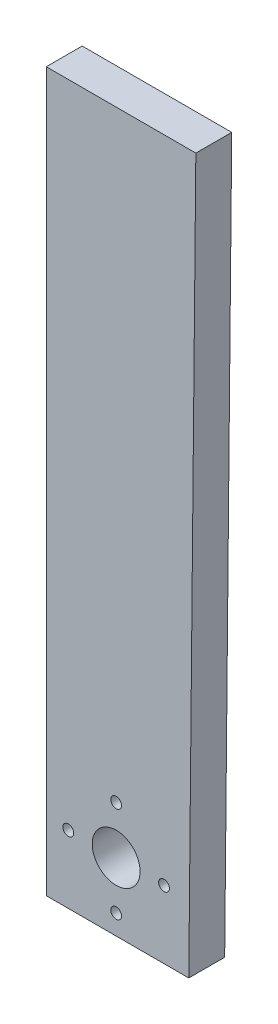
ISO-10303-21;
HEADER;
FILE_DESCRIPTION(('STEP AP214'),'2;1');
FILE_NAME('part.step','',(''),(''),'','','');
FILE_SCHEMA(('AUTOMOTIVE_DESIGN { 1 0 10303 214 1 1 1 1 }'));
ENDSEC;
DATA;
#1=APPLICATION_CONTEXT('core data for automotive mechanical design processes');
#2=APPLICATION_PROTOCOL_DEFINITION('international standard','automotive_design',2000,#1);
#3=PRODUCT_CONTEXT('',#1,'mechanical');
#4=PRODUCT('Part','Part','',(#3));
#5=PRODUCT_RELATED_PRODUCT_CATEGORY('part','',(#4));
#6=PRODUCT_DEFINITION_FORMATION('','',#4);
#7=PRODUCT_DEFINITION_CONTEXT('part definition',#1,'design');
#8=PRODUCT_DEFINITION('design','',#6,#7);
#9=PRODUCT_DEFINITION_SHAPE('','',#8);
#10=(LENGTH_UNIT() NAMED_UNIT(*) SI_UNIT(.MILLI.,.METRE.));
#11=(NAMED_UNIT(*) PLANE_ANGLE_UNIT() SI_UNIT($,.RADIAN.));
#12=(NAMED_UNIT(*) SI_UNIT($,.STERADIAN.) SOLID_ANGLE_UNIT());
#13=UNCERTAINTY_MEASURE_WITH_UNIT(LENGTH_MEASURE(1.E-05),#10,'distance_accuracy_value','');
#14=(GEOMETRIC_REPRESENTATION_CONTEXT(3) GLOBAL_UNCERTAINTY_ASSIGNED_CONTEXT((#13)) GLOBAL_UNIT_ASSIGNED_CONTEXT((#10,
#11,#12)) REPRESENTATION_CONTEXT('',''));
#15=CARTESIAN_POINT('',(0.,0.,0.));
#16=DIRECTION('',(0.,0.,1.));
#17=DIRECTION('',(1.,0.,0.));
#18=AXIS2_PLACEMENT_3D('',#15,#16,#17);
#19=CARTESIAN_POINT('',(0.,0.,6.));
#20=DIRECTION('',(0.,0.,-1.));
#21=DIRECTION('',(-1.,0.,0.));
#22=AXIS2_PLACEMENT_3D('',#19,#20,#21);
#23=PLANE('',#22);
#24=DIRECTION('',(1.,0.,0.));
#25=VECTOR('',#24,1.);
#26=CARTESIAN_POINT('',(48.8021307144799,-97.6102097446587,6.));
#27=LINE('',#26,#25);
#28=CARTESIAN_POINT('',(24.9825049823041,-97.6102097446587,6.));
#29=VERTEX_POINT('',#28);
#30=CARTESIAN_POINT('',(48.8021307144799,-97.6102097446587,6.));
#31=VERTEX_POINT('',#30);
#32=EDGE_CURVE('E85',#29,#31,#27,.T.);
#33=ORIENTED_EDGE('',*,*,#32,.T.);
#34=DIRECTION('',(0.00983597639953239,0.999951625614093,0.));
#35=VECTOR('',#34,1.);
#36=CARTESIAN_POINT('',(49.9825049823041,22.3897902553413,6.));
#37=LINE('',#36,#35);
#38=CARTESIAN_POINT('',(49.9825049823041,22.3897902553413,6.));
#39=VERTEX_POINT('',#38);
#40=EDGE_CURVE('E80',#31,#39,#37,.T.);
#41=ORIENTED_EDGE('',*,*,#40,.T.);
#42=DIRECTION('',(-1.,0.,0.));
#43=VECTOR('',#42,1.);
#44=CARTESIAN_POINT('',(49.9825049823041,22.3897902553413,6.));
#45=LINE('',#44,#43);
#46=CARTESIAN_POINT('',(24.9825049823041,22.3897902553413,6.));
#47=VERTEX_POINT('',#46);
#48=EDGE_CURVE('E83',#39,#47,#45,.T.);
#49=ORIENTED_EDGE('',*,*,#48,.T.);
#50=DIRECTION('',(0.,-1.,0.));
#51=VECTOR('',#50,1.);
#52=CARTESIAN_POINT('',(24.9825049823041,-97.6102097446587,6.));
#53=LINE('',#52,#51);
#54=EDGE_CURVE('E50',#47,#29,#53,.T.);
#55=ORIENTED_EDGE('',*,*,#54,.T.);
#56=EDGE_LOOP('',(#33,#41,#49,#55));
#57=FACE_BOUND('',#56,.T.);
#58=CARTESIAN_POINT('',(28.6640296021028,-86.2753700735329,6.));
#59=DIRECTION('',(0.,0.,1.));
#60=DIRECTION('',(1.,0.,0.));
#61=AXIS2_PLACEMENT_3D('',#58,#59,#60);
#62=CIRCLE('',#61,0.899999999999996);
#63=CARTESIAN_POINT('',(29.5640296021028,-86.2753700735329,6.));
#64=VERTEX_POINT('',#63);
#65=EDGE_CURVE('E100',#64,#64,#62,.T.);
#66=ORIENTED_EDGE('',*,*,#65,.F.);
#67=EDGE_LOOP('',(#66));
#68=FACE_BOUND('',#67,.T.);
#69=CARTESIAN_POINT('',(36.6640296021028,-78.2753700735329,6.));
#70=DIRECTION('',(0.,0.,1.));
#71=DIRECTION('',(1.,0.,0.));
#72=AXIS2_PLACEMENT_3D('',#69,#70,#71);
#73=CIRCLE('',#72,0.899999999999996);
#74=CARTESIAN_POINT('',(37.5640296021028,-78.2753700735329,6.));
#75=VERTEX_POINT('',#74);
#76=EDGE_CURVE('E115',#75,#75,#73,.T.);
#77=ORIENTED_EDGE('',*,*,#76,.F.);
#78=EDGE_LOOP('',(#77));
#79=FACE_BOUND('',#78,.T.);
#80=CARTESIAN_POINT('',(44.6640296021028,-86.2753700735329,6.));
#81=DIRECTION('',(0.,0.,1.));
#82=DIRECTION('',(1.,0.,0.));
#83=AXIS2_PLACEMENT_3D('',#80,#81,#82);
#84=CIRCLE('',#83,0.899999999999996);
#85=CARTESIAN_POINT('',(45.5640296021028,-86.2753700735329,6.));
#86=VERTEX_POINT('',#85);
#87=EDGE_CURVE('E121',#86,#86,#84,.T.);
#88=ORIENTED_EDGE('',*,*,#87,.F.);
#89=EDGE_LOOP('',(#88));
#90=FACE_BOUND('',#89,.T.);
#91=CARTESIAN_POINT('',(36.6640296021028,-94.275370073533,6.));
#92=DIRECTION('',(0.,0.,1.));
#93=DIRECTION('',(1.,0.,0.));
#94=AXIS2_PLACEMENT_3D('',#91,#92,#93);
#95=CIRCLE('',#94,0.899999999999996);
#96=CARTESIAN_POINT('',(37.5640296021028,-94.275370073533,6.));
#97=VERTEX_POINT('',#96);
#98=EDGE_CURVE('E127',#97,#97,#95,.T.);
#99=ORIENTED_EDGE('',*,*,#98,.F.);
#100=EDGE_LOOP('',(#99));
#101=FACE_BOUND('',#100,.T.);
#102=CARTESIAN_POINT('',(36.6640296021028,-86.2753700735329,6.));
#103=DIRECTION('',(0.,0.,1.));
#104=DIRECTION('',(1.,0.,0.));
#105=AXIS2_PLACEMENT_3D('',#102,#103,#104);
#106=CIRCLE('',#105,4.00000000000001);
#107=CARTESIAN_POINT('',(40.6640296021028,-86.2753700735329,6.));
#108=VERTEX_POINT('',#107);
#109=EDGE_CURVE('E133',#108,#108,#106,.T.);
#110=ORIENTED_EDGE('',*,*,#109,.F.);
#111=EDGE_LOOP('',(#110));
#112=FACE_BOUND('',#111,.T.);
#113=ADVANCED_FACE('F33',(#57,#68,#79,#90,#101,#112),#23,.F.);
#114=CARTESIAN_POINT('',(0.,0.,0.));
#115=DIRECTION('',(0.,0.,-1.));
#116=DIRECTION('',(-1.,0.,0.));
#117=AXIS2_PLACEMENT_3D('',#114,#115,#116);
#118=PLANE('',#117);
#119=CARTESIAN_POINT('',(36.6640296021028,-94.275370073533,0.));
#120=DIRECTION('',(0.,0.,1.));
#121=DIRECTION('',(1.,0.,0.));
#122=AXIS2_PLACEMENT_3D('',#119,#120,#121);
#123=CIRCLE('',#122,0.899999999999996);
#124=CARTESIAN_POINT('',(37.5640296021028,-94.275370073533,0.));
#125=VERTEX_POINT('',#124);
#126=EDGE_CURVE('E130',#125,#125,#123,.T.);
#127=ORIENTED_EDGE('',*,*,#126,.T.);
#128=EDGE_LOOP('',(#127));
#129=FACE_BOUND('',#128,.T.);
#130=CARTESIAN_POINT('',(36.6640296021028,-78.2753700735329,0.));
#131=DIRECTION('',(0.,0.,1.));
#132=DIRECTION('',(1.,0.,0.));
#133=AXIS2_PLACEMENT_3D('',#130,#131,#132);
#134=CIRCLE('',#133,0.899999999999996);
#135=CARTESIAN_POINT('',(37.5640296021028,-78.2753700735329,0.));
#136=VERTEX_POINT('',#135);
#137=EDGE_CURVE('E118',#136,#136,#134,.T.);
#138=ORIENTED_EDGE('',*,*,#137,.T.);
#139=EDGE_LOOP('',(#138));
#140=FACE_BOUND('',#139,.T.);
#141=DIRECTION('',(1.,0.,0.));
#142=VECTOR('',#141,1.);
#143=CARTESIAN_POINT('',(48.8021307144799,-97.6102097446587,0.));
#144=LINE('',#143,#142);
#145=CARTESIAN_POINT('',(24.9825049823041,-97.6102097446587,0.));
#146=VERTEX_POINT('',#145);
#147=CARTESIAN_POINT('',(48.8021307144799,-97.6102097446587,0.));
#148=VERTEX_POINT('',#147);
#149=EDGE_CURVE('E97',#146,#148,#144,.T.);
#150=ORIENTED_EDGE('',*,*,#149,.F.);
#151=DIRECTION('',(0.,-1.,0.));
#152=VECTOR('',#151,1.);
#153=CARTESIAN_POINT('',(24.9825049823041,-97.6102097446587,0.));
#154=LINE('',#153,#152);
#155=CARTESIAN_POINT('',(24.9825049823041,22.3897902553413,0.));
#156=VERTEX_POINT('',#155);
#157=EDGE_CURVE('E73',#156,#146,#154,.T.);
#158=ORIENTED_EDGE('',*,*,#157,.F.);
#159=DIRECTION('',(-1.,0.,0.));
#160=VECTOR('',#159,1.);
#161=CARTESIAN_POINT('',(49.9825049823041,22.3897902553413,0.));
#162=LINE('',#161,#160);
#163=CARTESIAN_POINT('',(49.9825049823041,22.3897902553413,0.));
#164=VERTEX_POINT('',#163);
#165=EDGE_CURVE('E67',#164,#156,#162,.T.);
#166=ORIENTED_EDGE('',*,*,#165,.F.);
#167=DIRECTION('',(0.00983597639953239,0.999951625614093,0.));
#168=VECTOR('',#167,1.);
#169=CARTESIAN_POINT('',(49.9825049823041,22.3897902553413,0.));
#170=LINE('',#169,#168);
#171=EDGE_CURVE('E89',#148,#164,#170,.T.);
#172=ORIENTED_EDGE('',*,*,#171,.F.);
#173=EDGE_LOOP('',(#150,#158,#166,#172));
#174=FACE_BOUND('',#173,.T.);
#175=CARTESIAN_POINT('',(28.6640296021028,-86.2753700735329,0.));
#176=DIRECTION('',(0.,0.,1.));
#177=DIRECTION('',(1.,0.,0.));
#178=AXIS2_PLACEMENT_3D('',#175,#176,#177);
#179=CIRCLE('',#178,0.899999999999996);
#180=CARTESIAN_POINT('',(29.5640296021028,-86.2753700735329,0.));
#181=VERTEX_POINT('',#180);
#182=EDGE_CURVE('E112',#181,#181,#179,.T.);
#183=ORIENTED_EDGE('',*,*,#182,.T.);
#184=EDGE_LOOP('',(#183));
#185=FACE_BOUND('',#184,.T.);
#186=CARTESIAN_POINT('',(44.6640296021028,-86.2753700735329,0.));
#187=DIRECTION('',(0.,0.,1.));
#188=DIRECTION('',(1.,0.,0.));
#189=AXIS2_PLACEMENT_3D('',#186,#187,#188);
#190=CIRCLE('',#189,0.899999999999996);
#191=CARTESIAN_POINT('',(45.5640296021028,-86.2753700735329,0.));
#192=VERTEX_POINT('',#191);
#193=EDGE_CURVE('E124',#192,#192,#190,.T.);
#194=ORIENTED_EDGE('',*,*,#193,.T.);
#195=EDGE_LOOP('',(#194));
#196=FACE_BOUND('',#195,.T.);
#197=CARTESIAN_POINT('',(36.6640296021028,-86.2753700735329,0.));
#198=DIRECTION('',(0.,0.,1.));
#199=DIRECTION('',(1.,0.,0.));
#200=AXIS2_PLACEMENT_3D('',#197,#198,#199);
#201=CIRCLE('',#200,4.00000000000001);
#202=CARTESIAN_POINT('',(40.6640296021028,-86.2753700735329,0.));
#203=VERTEX_POINT('',#202);
#204=EDGE_CURVE('E136',#203,#203,#201,.T.);
#205=ORIENTED_EDGE('',*,*,#204,.T.);
#206=EDGE_LOOP('',(#205));
#207=FACE_BOUND('',#206,.T.);
#208=ADVANCED_FACE('F108',(#129,#140,#174,#185,#196,#207),#118,.T.);
#209=CARTESIAN_POINT('',(48.8021307144799,-97.6102097446587,6.));
#210=DIRECTION('',(0.,1.,0.));
#211=DIRECTION('',(0.,0.,1.));
#212=AXIS2_PLACEMENT_3D('',#209,#210,#211);
#213=PLANE('',#212);
#214=ORIENTED_EDGE('',*,*,#149,.T.);
#215=DIRECTION('',(0.,0.,-1.));
#216=VECTOR('',#215,1.);
#217=CARTESIAN_POINT('',(48.8021307144799,-97.6102097446587,6.));
#218=LINE('',#217,#216);
#219=EDGE_CURVE('E11',#31,#148,#218,.T.);
#220=ORIENTED_EDGE('',*,*,#219,.F.);
#221=ORIENTED_EDGE('',*,*,#32,.F.);
#222=DIRECTION('',(0.,0.,-1.));
#223=VECTOR('',#222,1.);
#224=CARTESIAN_POINT('',(24.9825049823041,-97.6102097446587,6.));
#225=LINE('',#224,#223);
#226=EDGE_CURVE('E93',#29,#146,#225,.T.);
#227=ORIENTED_EDGE('',*,*,#226,.T.);
#228=EDGE_LOOP('',(#214,#220,#221,#227));
#229=FACE_BOUND('',#228,.T.);
#230=ADVANCED_FACE('F35',(#229),#213,.F.);
#231=CARTESIAN_POINT('',(49.9825049823041,22.3897902553413,6.));
#232=DIRECTION('',(-0.999951625614093,0.00983597639953239,0.));
#233=DIRECTION('',(-0.00983597639953239,-0.999951625614093,0.));
#234=AXIS2_PLACEMENT_3D('',#231,#232,#233);
#235=PLANE('',#234);
#236=ORIENTED_EDGE('',*,*,#171,.T.);
#237=DIRECTION('',(0.,0.,-1.));
#238=VECTOR('',#237,1.);
#239=CARTESIAN_POINT('',(49.9825049823041,22.3897902553413,6.));
#240=LINE('',#239,#238);
#241=EDGE_CURVE('E42',#39,#164,#240,.T.);
#242=ORIENTED_EDGE('',*,*,#241,.F.);
#243=ORIENTED_EDGE('',*,*,#40,.F.);
#244=ORIENTED_EDGE('',*,*,#219,.T.);
#245=EDGE_LOOP('',(#236,#242,#243,#244));
#246=FACE_BOUND('',#245,.T.);
#247=ADVANCED_FACE('F88',(#246),#235,.F.);
#248=CARTESIAN_POINT('',(49.9825049823041,22.3897902553413,6.));
#249=DIRECTION('',(0.,-1.,0.));
#250=DIRECTION('',(1.,0.,0.));
#251=AXIS2_PLACEMENT_3D('',#248,#249,#250);
#252=PLANE('',#251);
#253=ORIENTED_EDGE('',*,*,#165,.T.);
#254=DIRECTION('',(0.,0.,-1.));
#255=VECTOR('',#254,1.);
#256=CARTESIAN_POINT('',(24.9825049823041,22.3897902553413,6.));
#257=LINE('',#256,#255);
#258=EDGE_CURVE('E90',#47,#156,#257,.T.);
#259=ORIENTED_EDGE('',*,*,#258,.F.);
#260=ORIENTED_EDGE('',*,*,#48,.F.);
#261=ORIENTED_EDGE('',*,*,#241,.T.);
#262=EDGE_LOOP('',(#253,#259,#260,#261));
#263=FACE_BOUND('',#262,.T.);
#264=ADVANCED_FACE('F91',(#263),#252,.F.);
#265=CARTESIAN_POINT('',(24.9825049823041,-97.6102097446587,6.));
#266=DIRECTION('',(1.,0.,0.));
#267=DIRECTION('',(0.,0.,-1.));
#268=AXIS2_PLACEMENT_3D('',#265,#266,#267);
#269=PLANE('',#268);
#270=ORIENTED_EDGE('',*,*,#157,.T.);
#271=ORIENTED_EDGE('',*,*,#226,.F.);
#272=ORIENTED_EDGE('',*,*,#54,.F.);
#273=ORIENTED_EDGE('',*,*,#258,.T.);
#274=EDGE_LOOP('',(#270,#271,#272,#273));
#275=FACE_BOUND('',#274,.T.);
#276=ADVANCED_FACE('F105',(#275),#269,.F.);
#277=CARTESIAN_POINT('',(28.6640296021028,-86.2753700735329,6.));
#278=DIRECTION('',(0.,0.,-1.));
#279=DIRECTION('',(-1.,0.,0.));
#280=AXIS2_PLACEMENT_3D('',#277,#278,#279);
#281=CYLINDRICAL_SURFACE('',#280,0.899999999999996);
#282=ORIENTED_EDGE('',*,*,#65,.T.);
#283=EDGE_LOOP('',(#282));
#284=FACE_BOUND('',#283,.T.);
#285=ORIENTED_EDGE('',*,*,#182,.F.);
#286=EDGE_LOOP('',(#285));
#287=FACE_BOUND('',#286,.T.);
#288=ADVANCED_FACE('F153',(#284,#287),#281,.F.);
#289=CARTESIAN_POINT('',(36.6640296021028,-78.2753700735329,6.));
#290=DIRECTION('',(0.,0.,-1.));
#291=DIRECTION('',(-1.,0.,0.));
#292=AXIS2_PLACEMENT_3D('',#289,#290,#291);
#293=CYLINDRICAL_SURFACE('',#292,0.899999999999996);
#294=ORIENTED_EDGE('',*,*,#76,.T.);
#295=EDGE_LOOP('',(#294));
#296=FACE_BOUND('',#295,.T.);
#297=ORIENTED_EDGE('',*,*,#137,.F.);
#298=EDGE_LOOP('',(#297));
#299=FACE_BOUND('',#298,.T.);
#300=ADVANCED_FACE('F199',(#296,#299),#293,.F.);
#301=CARTESIAN_POINT('',(44.6640296021028,-86.2753700735329,6.));
#302=DIRECTION('',(0.,0.,-1.));
#303=DIRECTION('',(-1.,0.,0.));
#304=AXIS2_PLACEMENT_3D('',#301,#302,#303);
#305=CYLINDRICAL_SURFACE('',#304,0.899999999999996);
#306=ORIENTED_EDGE('',*,*,#87,.T.);
#307=EDGE_LOOP('',(#306));
#308=FACE_BOUND('',#307,.T.);
#309=ORIENTED_EDGE('',*,*,#193,.F.);
#310=EDGE_LOOP('',(#309));
#311=FACE_BOUND('',#310,.T.);
#312=ADVANCED_FACE('F207',(#308,#311),#305,.F.);
#313=CARTESIAN_POINT('',(36.6640296021028,-94.275370073533,6.));
#314=DIRECTION('',(0.,0.,-1.));
#315=DIRECTION('',(-1.,0.,0.));
#316=AXIS2_PLACEMENT_3D('',#313,#314,#315);
#317=CYLINDRICAL_SURFACE('',#316,0.899999999999996);
#318=ORIENTED_EDGE('',*,*,#98,.T.);
#319=EDGE_LOOP('',(#318));
#320=FACE_BOUND('',#319,.T.);
#321=ORIENTED_EDGE('',*,*,#126,.F.);
#322=EDGE_LOOP('',(#321));
#323=FACE_BOUND('',#322,.T.);
#324=ADVANCED_FACE('F215',(#320,#323),#317,.F.);
#325=CARTESIAN_POINT('',(36.6640296021028,-86.2753700735329,6.));
#326=DIRECTION('',(0.,0.,-1.));
#327=DIRECTION('',(-1.,0.,0.));
#328=AXIS2_PLACEMENT_3D('',#325,#326,#327);
#329=CYLINDRICAL_SURFACE('',#328,4.00000000000001);
#330=ORIENTED_EDGE('',*,*,#109,.T.);
#331=EDGE_LOOP('',(#330));
#332=FACE_BOUND('',#331,.T.);
#333=ORIENTED_EDGE('',*,*,#204,.F.);
#334=EDGE_LOOP('',(#333));
#335=FACE_BOUND('',#334,.T.);
#336=ADVANCED_FACE('F142',(#332,#335),#329,.F.);
#337=CLOSED_SHELL('',(#113,#208,#230,#247,#264,#276,#288,#300,#312,#324,#336));
#338=MANIFOLD_SOLID_BREP('B2',#337);
#339=ADVANCED_BREP_SHAPE_REPRESENTATION('',(#18,#338),#14);
#340=SHAPE_DEFINITION_REPRESENTATION(#9,#339);
ENDSEC;
END-ISO-10303-21;
